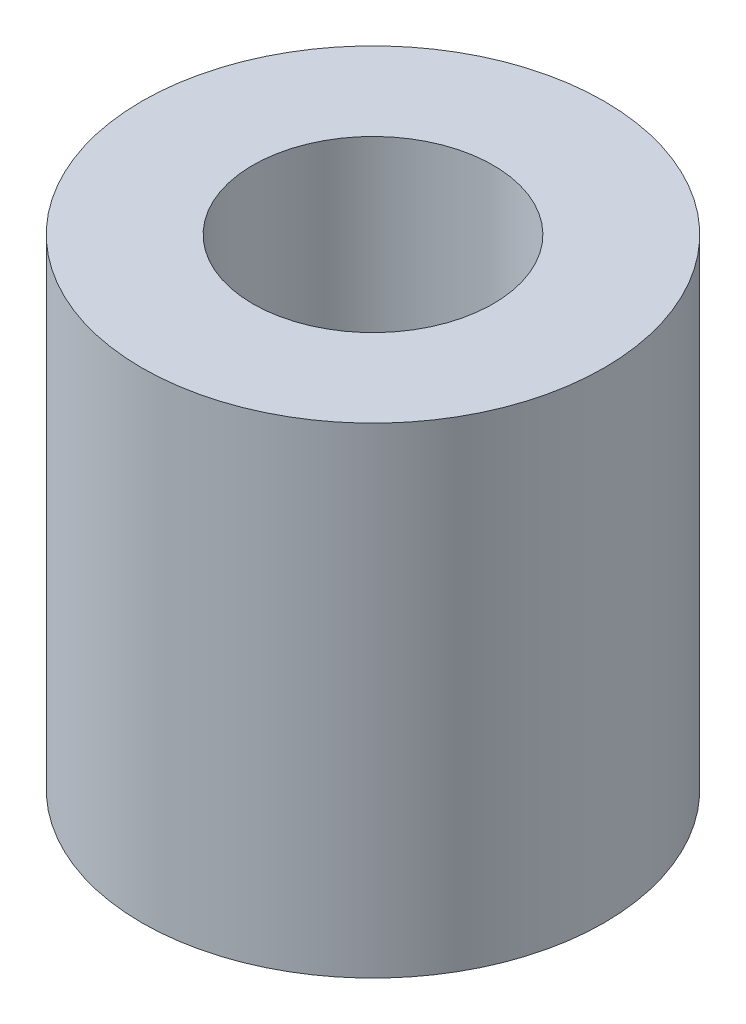
ISO-10303-21;
HEADER;
FILE_DESCRIPTION(('STEP AP214'),'2;1');
FILE_NAME('part.step','',(''),(''),'','','');
FILE_SCHEMA(('AUTOMOTIVE_DESIGN { 1 0 10303 214 1 1 1 1 }'));
ENDSEC;
DATA;
#1=APPLICATION_CONTEXT('core data for automotive mechanical design processes');
#2=APPLICATION_PROTOCOL_DEFINITION('international standard','automotive_design',2000,#1);
#3=PRODUCT_CONTEXT('',#1,'mechanical');
#4=PRODUCT('Part','Part','',(#3));
#5=PRODUCT_RELATED_PRODUCT_CATEGORY('part','',(#4));
#6=PRODUCT_DEFINITION_FORMATION('','',#4);
#7=PRODUCT_DEFINITION_CONTEXT('part definition',#1,'design');
#8=PRODUCT_DEFINITION('design','',#6,#7);
#9=PRODUCT_DEFINITION_SHAPE('','',#8);
#10=(LENGTH_UNIT() NAMED_UNIT(*) SI_UNIT(.MILLI.,.METRE.));
#11=(NAMED_UNIT(*) PLANE_ANGLE_UNIT() SI_UNIT($,.RADIAN.));
#12=(NAMED_UNIT(*) SI_UNIT($,.STERADIAN.) SOLID_ANGLE_UNIT());
#13=UNCERTAINTY_MEASURE_WITH_UNIT(LENGTH_MEASURE(1.E-05),#10,'distance_accuracy_value','');
#14=(GEOMETRIC_REPRESENTATION_CONTEXT(3) GLOBAL_UNCERTAINTY_ASSIGNED_CONTEXT((#13)) GLOBAL_UNIT_ASSIGNED_CONTEXT((#10,
#11,#12)) REPRESENTATION_CONTEXT('',''));
#15=CARTESIAN_POINT('',(0.,0.,0.));
#16=DIRECTION('',(0.,0.,1.));
#17=DIRECTION('',(1.,0.,0.));
#18=AXIS2_PLACEMENT_3D('',#15,#16,#17);
#19=CARTESIAN_POINT('',(0.,26.,0.));
#20=DIRECTION('',(0.,1.,0.));
#21=DIRECTION('',(0.,0.,1.));
#22=AXIS2_PLACEMENT_3D('',#19,#20,#21);
#23=PLANE('',#22);
#24=CARTESIAN_POINT('',(0.,26.,0.));
#25=DIRECTION('',(0.,1.,0.));
#26=DIRECTION('',(0.,0.,1.));
#27=AXIS2_PLACEMENT_3D('',#24,#25,#26);
#28=CIRCLE('',#27,12.5);
#29=CARTESIAN_POINT('',(0.,26.,12.5));
#30=VERTEX_POINT('',#29);
#31=EDGE_CURVE('E10',#30,#30,#28,.T.);
#32=ORIENTED_EDGE('',*,*,#31,.T.);
#33=EDGE_LOOP('',(#32));
#34=FACE_BOUND('',#33,.T.);
#35=CARTESIAN_POINT('',(0.,26.,0.));
#36=DIRECTION('',(0.,1.,0.));
#37=DIRECTION('',(0.,0.,1.));
#38=AXIS2_PLACEMENT_3D('',#35,#36,#37);
#39=CIRCLE('',#38,6.5);
#40=CARTESIAN_POINT('',(0.,26.,6.5));
#41=VERTEX_POINT('',#40);
#42=EDGE_CURVE('E41',#41,#41,#39,.T.);
#43=ORIENTED_EDGE('',*,*,#42,.F.);
#44=EDGE_LOOP('',(#43));
#45=FACE_BOUND('',#44,.T.);
#46=ADVANCED_FACE('F30',(#34,#45),#23,.T.);
#47=CARTESIAN_POINT('',(0.,0.,0.));
#48=DIRECTION('',(0.,1.,0.));
#49=DIRECTION('',(0.,0.,1.));
#50=AXIS2_PLACEMENT_3D('',#47,#48,#49);
#51=PLANE('',#50);
#52=CARTESIAN_POINT('',(0.,0.,0.));
#53=DIRECTION('',(0.,1.,0.));
#54=DIRECTION('',(0.,0.,1.));
#55=AXIS2_PLACEMENT_3D('',#52,#53,#54);
#56=CIRCLE('',#55,12.5);
#57=CARTESIAN_POINT('',(0.,0.,12.5));
#58=VERTEX_POINT('',#57);
#59=EDGE_CURVE('E34',#58,#58,#56,.T.);
#60=ORIENTED_EDGE('',*,*,#59,.F.);
#61=EDGE_LOOP('',(#60));
#62=FACE_BOUND('',#61,.T.);
#63=CARTESIAN_POINT('',(0.,0.,0.));
#64=DIRECTION('',(0.,1.,0.));
#65=DIRECTION('',(0.,0.,1.));
#66=AXIS2_PLACEMENT_3D('',#63,#64,#65);
#67=CIRCLE('',#66,6.5);
#68=CARTESIAN_POINT('',(0.,0.,6.5));
#69=VERTEX_POINT('',#68);
#70=EDGE_CURVE('E43',#69,#69,#67,.T.);
#71=ORIENTED_EDGE('',*,*,#70,.T.);
#72=EDGE_LOOP('',(#71));
#73=FACE_BOUND('',#72,.T.);
#74=ADVANCED_FACE('F53',(#62,#73),#51,.F.);
#75=CARTESIAN_POINT('',(0.,26.,0.));
#76=DIRECTION('',(0.,-1.,0.));
#77=DIRECTION('',(0.,0.,-1.));
#78=AXIS2_PLACEMENT_3D('',#75,#76,#77);
#79=CYLINDRICAL_SURFACE('',#78,12.5);
#80=ORIENTED_EDGE('',*,*,#31,.F.);
#81=EDGE_LOOP('',(#80));
#82=FACE_BOUND('',#81,.T.);
#83=ORIENTED_EDGE('',*,*,#59,.T.);
#84=EDGE_LOOP('',(#83));
#85=FACE_BOUND('',#84,.T.);
#86=ADVANCED_FACE('F32',(#82,#85),#79,.T.);
#87=CARTESIAN_POINT('',(0.,26.,0.));
#88=DIRECTION('',(0.,-1.,0.));
#89=DIRECTION('',(0.,0.,-1.));
#90=AXIS2_PLACEMENT_3D('',#87,#88,#89);
#91=CYLINDRICAL_SURFACE('',#90,6.5);
#92=ORIENTED_EDGE('',*,*,#42,.T.);
#93=EDGE_LOOP('',(#92));
#94=FACE_BOUND('',#93,.T.);
#95=ORIENTED_EDGE('',*,*,#70,.F.);
#96=EDGE_LOOP('',(#95));
#97=FACE_BOUND('',#96,.T.);
#98=ADVANCED_FACE('F49',(#94,#97),#91,.F.);
#99=CLOSED_SHELL('',(#46,#74,#86,#98));
#100=MANIFOLD_SOLID_BREP('B2',#99);
#101=ADVANCED_BREP_SHAPE_REPRESENTATION('',(#18,#100),#14);
#102=SHAPE_DEFINITION_REPRESENTATION(#9,#101);
ENDSEC;
END-ISO-10303-21;
